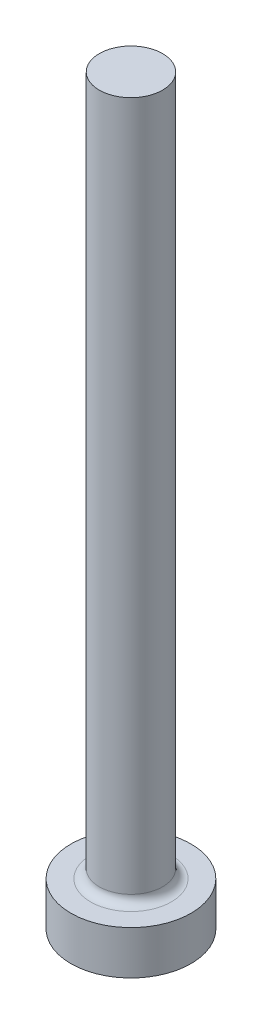
ISO-10303-21;
HEADER;
FILE_DESCRIPTION(('STEP AP214'),'2;1');
FILE_NAME('part.step','',(''),(''),'','','');
FILE_SCHEMA(('AUTOMOTIVE_DESIGN { 1 0 10303 214 1 1 1 1 }'));
ENDSEC;
DATA;
#1=APPLICATION_CONTEXT('core data for automotive mechanical design processes');
#2=APPLICATION_PROTOCOL_DEFINITION('international standard','automotive_design',2000,#1);
#3=PRODUCT_CONTEXT('',#1,'mechanical');
#4=PRODUCT('Part','Part','',(#3));
#5=PRODUCT_RELATED_PRODUCT_CATEGORY('part','',(#4));
#6=PRODUCT_DEFINITION_FORMATION('','',#4);
#7=PRODUCT_DEFINITION_CONTEXT('part definition',#1,'design');
#8=PRODUCT_DEFINITION('design','',#6,#7);
#9=PRODUCT_DEFINITION_SHAPE('','',#8);
#10=(LENGTH_UNIT() NAMED_UNIT(*) SI_UNIT(.MILLI.,.METRE.));
#11=(NAMED_UNIT(*) PLANE_ANGLE_UNIT() SI_UNIT($,.RADIAN.));
#12=(NAMED_UNIT(*) SI_UNIT($,.STERADIAN.) SOLID_ANGLE_UNIT());
#13=UNCERTAINTY_MEASURE_WITH_UNIT(LENGTH_MEASURE(1.E-05),#10,'distance_accuracy_value','');
#14=(GEOMETRIC_REPRESENTATION_CONTEXT(3) GLOBAL_UNCERTAINTY_ASSIGNED_CONTEXT((#13)) GLOBAL_UNIT_ASSIGNED_CONTEXT((#10,
#11,#12)) REPRESENTATION_CONTEXT('',''));
#15=CARTESIAN_POINT('',(0.,0.,0.));
#16=DIRECTION('',(0.,0.,1.));
#17=DIRECTION('',(1.,0.,0.));
#18=AXIS2_PLACEMENT_3D('',#15,#16,#17);
#19=CARTESIAN_POINT('',(0.,2.,0.));
#20=DIRECTION('',(0.,-1.,0.));
#21=DIRECTION('',(0.,0.,-1.));
#22=AXIS2_PLACEMENT_3D('',#19,#20,#21);
#23=CYLINDRICAL_SURFACE('',#22,2.75);
#24=CARTESIAN_POINT('',(0.,2.,0.));
#25=DIRECTION('',(0.,1.,0.));
#26=DIRECTION('',(0.,0.,1.));
#27=AXIS2_PLACEMENT_3D('',#24,#25,#26);
#28=CIRCLE('',#27,2.75);
#29=CARTESIAN_POINT('',(0.,2.,2.75));
#30=VERTEX_POINT('',#29);
#31=EDGE_CURVE('E44',#30,#30,#28,.T.);
#32=ORIENTED_EDGE('',*,*,#31,.F.);
#33=EDGE_LOOP('',(#32));
#34=FACE_BOUND('',#33,.T.);
#35=CARTESIAN_POINT('',(0.,0.,0.));
#36=DIRECTION('',(0.,1.,0.));
#37=DIRECTION('',(0.,0.,1.));
#38=AXIS2_PLACEMENT_3D('',#35,#36,#37);
#39=CIRCLE('',#38,2.75);
#40=CARTESIAN_POINT('',(0.,0.,2.75));
#41=VERTEX_POINT('',#40);
#42=EDGE_CURVE('E48',#41,#41,#39,.T.);
#43=ORIENTED_EDGE('',*,*,#42,.T.);
#44=EDGE_LOOP('',(#43));
#45=FACE_BOUND('',#44,.T.);
#46=ADVANCED_FACE('F33',(#34,#45),#23,.T.);
#47=CARTESIAN_POINT('',(0.,2.,0.));
#48=DIRECTION('',(0.,1.,0.));
#49=DIRECTION('',(0.,0.,1.));
#50=AXIS2_PLACEMENT_3D('',#47,#48,#49);
#51=PLANE('',#50);
#52=CARTESIAN_POINT('',(0.,2.,0.));
#53=DIRECTION('',(0.,1.,0.));
#54=DIRECTION('',(0.,0.,1.));
#55=AXIS2_PLACEMENT_3D('',#52,#53,#54);
#56=CIRCLE('',#55,1.85);
#57=CARTESIAN_POINT('',(0.,2.,1.85));
#58=VERTEX_POINT('',#57);
#59=EDGE_CURVE('E10',#58,#58,#56,.F.);
#60=ORIENTED_EDGE('',*,*,#59,.T.);
#61=EDGE_LOOP('',(#60));
#62=FACE_BOUND('',#61,.T.);
#63=ORIENTED_EDGE('',*,*,#31,.T.);
#64=EDGE_LOOP('',(#63));
#65=FACE_BOUND('',#64,.T.);
#66=ADVANCED_FACE('F68',(#62,#65),#51,.T.);
#67=CARTESIAN_POINT('',(0.,0.,0.));
#68=DIRECTION('',(0.,1.,0.));
#69=DIRECTION('',(0.,0.,1.));
#70=AXIS2_PLACEMENT_3D('',#67,#68,#69);
#71=PLANE('',#70);
#72=ORIENTED_EDGE('',*,*,#42,.F.);
#73=EDGE_LOOP('',(#72));
#74=FACE_BOUND('',#73,.T.);
#75=ADVANCED_FACE('F61',(#74),#71,.F.);
#76=CARTESIAN_POINT('',(0.,34.,0.));
#77=DIRECTION('',(0.,-1.,0.));
#78=DIRECTION('',(0.,0.,-1.));
#79=AXIS2_PLACEMENT_3D('',#76,#77,#78);
#80=CYLINDRICAL_SURFACE('',#79,1.45);
#81=CARTESIAN_POINT('',(0.,2.4,0.));
#82=DIRECTION('',(0.,1.,0.));
#83=DIRECTION('',(0.,0.,1.));
#84=AXIS2_PLACEMENT_3D('',#81,#82,#83);
#85=CIRCLE('',#84,1.45);
#86=CARTESIAN_POINT('',(0.,2.4,1.45));
#87=VERTEX_POINT('',#86);
#88=EDGE_CURVE('E40',#87,#87,#85,.T.);
#89=ORIENTED_EDGE('',*,*,#88,.T.);
#90=EDGE_LOOP('',(#89));
#91=FACE_BOUND('',#90,.T.);
#92=CARTESIAN_POINT('',(0.,34.,0.));
#93=DIRECTION('',(0.,1.,0.));
#94=DIRECTION('',(0.,0.,1.));
#95=AXIS2_PLACEMENT_3D('',#92,#93,#94);
#96=CIRCLE('',#95,1.45);
#97=CARTESIAN_POINT('',(0.,34.,1.45));
#98=VERTEX_POINT('',#97);
#99=EDGE_CURVE('E52',#98,#98,#96,.T.);
#100=ORIENTED_EDGE('',*,*,#99,.F.);
#101=EDGE_LOOP('',(#100));
#102=FACE_BOUND('',#101,.T.);
#103=ADVANCED_FACE('F59',(#91,#102),#80,.T.);
#104=CARTESIAN_POINT('',(0.,34.,0.));
#105=DIRECTION('',(0.,1.,0.));
#106=DIRECTION('',(0.,0.,1.));
#107=AXIS2_PLACEMENT_3D('',#104,#105,#106);
#108=PLANE('',#107);
#109=ORIENTED_EDGE('',*,*,#99,.T.);
#110=EDGE_LOOP('',(#109));
#111=FACE_BOUND('',#110,.T.);
#112=ADVANCED_FACE('F57',(#111),#108,.T.);
#113=CARTESIAN_POINT('',(0.,2.4,0.));
#114=DIRECTION('',(0.,1.,0.));
#115=DIRECTION('',(0.,0.,1.));
#116=AXIS2_PLACEMENT_3D('',#113,#114,#115);
#117=TOROIDAL_SURFACE('',#116,1.85,0.4);
#118=ORIENTED_EDGE('',*,*,#59,.F.);
#119=EDGE_LOOP('',(#118));
#120=FACE_BOUND('',#119,.T.);
#121=ORIENTED_EDGE('',*,*,#88,.F.);
#122=EDGE_LOOP('',(#121));
#123=FACE_BOUND('',#122,.T.);
#124=ADVANCED_FACE('F35',(#120,#123),#117,.F.);
#125=CLOSED_SHELL('',(#46,#66,#75,#103,#112,#124));
#126=MANIFOLD_SOLID_BREP('B2',#125);
#127=ADVANCED_BREP_SHAPE_REPRESENTATION('',(#18,#126),#14);
#128=SHAPE_DEFINITION_REPRESENTATION(#9,#127);
ENDSEC;
END-ISO-10303-21;
